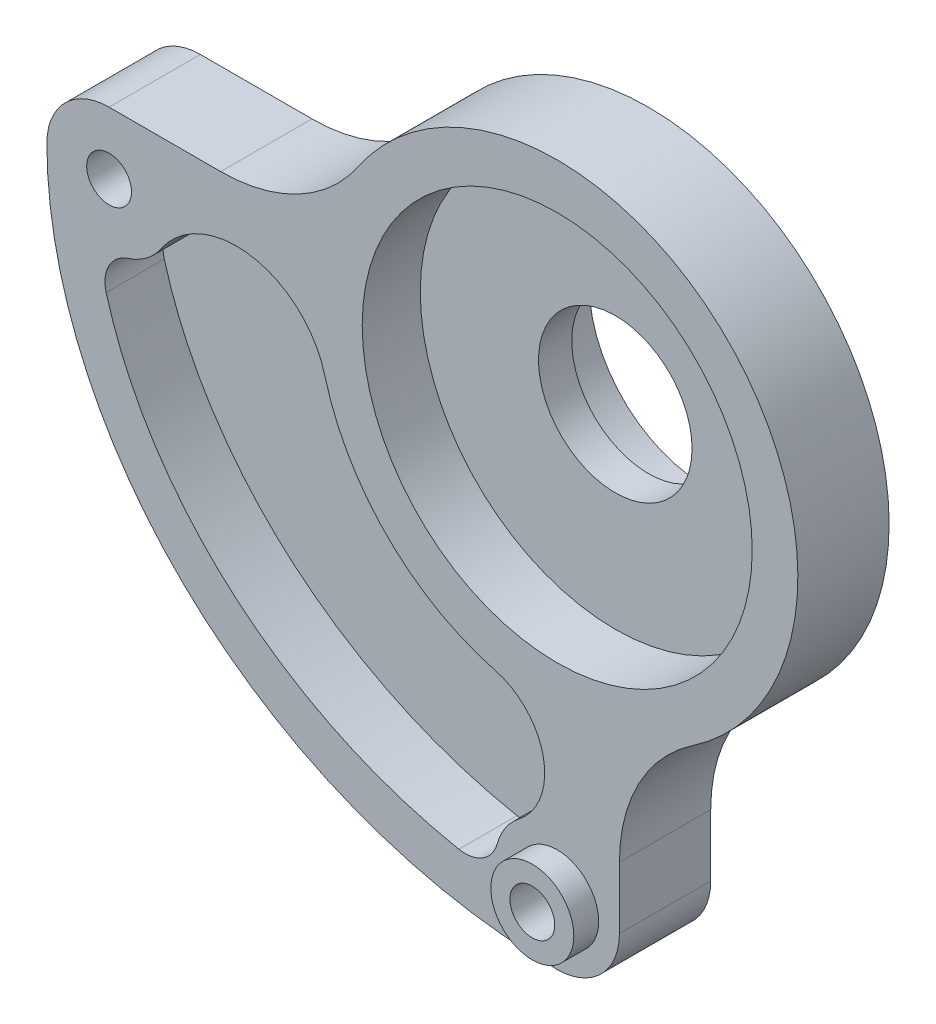
ISO-10303-21;
HEADER;
FILE_DESCRIPTION(('STEP AP214'),'2;1');
FILE_NAME('part.step','',(''),(''),'','','');
FILE_SCHEMA(('AUTOMOTIVE_DESIGN { 1 0 10303 214 1 1 1 1 }'));
ENDSEC;
DATA;
#1=APPLICATION_CONTEXT('core data for automotive mechanical design processes');
#2=APPLICATION_PROTOCOL_DEFINITION('international standard','automotive_design',2000,#1);
#3=PRODUCT_CONTEXT('',#1,'mechanical');
#4=PRODUCT('Part','Part','',(#3));
#5=PRODUCT_RELATED_PRODUCT_CATEGORY('part','',(#4));
#6=PRODUCT_DEFINITION_FORMATION('','',#4);
#7=PRODUCT_DEFINITION_CONTEXT('part definition',#1,'design');
#8=PRODUCT_DEFINITION('design','',#6,#7);
#9=PRODUCT_DEFINITION_SHAPE('','',#8);
#10=(LENGTH_UNIT() NAMED_UNIT(*) SI_UNIT(.MILLI.,.METRE.));
#11=(NAMED_UNIT(*) PLANE_ANGLE_UNIT() SI_UNIT($,.RADIAN.));
#12=(NAMED_UNIT(*) SI_UNIT($,.STERADIAN.) SOLID_ANGLE_UNIT());
#13=UNCERTAINTY_MEASURE_WITH_UNIT(LENGTH_MEASURE(1.E-05),#10,'distance_accuracy_value','');
#14=(GEOMETRIC_REPRESENTATION_CONTEXT(3) GLOBAL_UNCERTAINTY_ASSIGNED_CONTEXT((#13)) GLOBAL_UNIT_ASSIGNED_CONTEXT((#10,
#11,#12)) REPRESENTATION_CONTEXT('',''));
#15=CARTESIAN_POINT('',(0.,0.,0.));
#16=DIRECTION('',(0.,0.,1.));
#17=DIRECTION('',(1.,0.,0.));
#18=AXIS2_PLACEMENT_3D('',#15,#16,#17);
#19=CARTESIAN_POINT('',(0.,0.,8.93));
#20=DIRECTION('',(0.,0.,1.));
#21=DIRECTION('',(1.,0.,0.));
#22=AXIS2_PLACEMENT_3D('',#19,#20,#21);
#23=PLANE('',#22);
#24=CARTESIAN_POINT('',(-28.0011801821374,-8.45388369909683E-05,8.93));
#25=CARTESIAN_POINT('',(-28.0011232421343,-3.23355608710236,8.93));
#26=CARTESIAN_POINT('',(-26.5801767404547,-9.70171557995317,8.93));
#27=CARTESIAN_POINT('',(-20.4333715128919,-18.0293929282947,8.93));
#28=CARTESIAN_POINT('',(-12.653019421962,-22.727558911828,8.93));
#29=CARTESIAN_POINT('',(-5.55262158830502,-24.6710685207622,8.93));
#30=CARTESIAN_POINT('',(-1.84494688072152,-25.0003433157603,8.93));
#31=CARTESIAN_POINT('',(6.57625961889916E-05,-25.0003108259041,8.93));
#32=B_SPLINE_CURVE_WITH_KNOTS('',3,(#24,#25,#26,#27,#28,#29,#30,#31),.UNSPECIFIED.,.F.,.F.,(4,1,
1,1,1,4),(0.,0.392699081698724,0.785398163397448,1.17809724509617,1.37444678594553,
1.5707963267949),.UNSPECIFIED.);
#33=CARTESIAN_POINT('',(-27.1773193384946,-6.01212685681124,8.93));
#34=VERTEX_POINT('',#33);
#35=CARTESIAN_POINT('',(-5.92226507473119,-24.4342817661505,8.93));
#36=VERTEX_POINT('',#35);
#37=EDGE_CURVE('E165',#34,#36,#32,.T.);
#38=ORIENTED_EDGE('',*,*,#37,.F.);
#39=CARTESIAN_POINT('',(-25.2501618620842,-5.47727728813279,8.93));
#40=DIRECTION('',(0.,0.,1.));
#41=DIRECTION('',(1.,0.,0.));
#42=AXIS2_PLACEMENT_3D('',#39,#40,#41);
#43=CIRCLE('',#42,2.);
#44=CARTESIAN_POINT('',(-25.8588012144027,-3.57213736182573,8.93));
#45=VERTEX_POINT('',#44);
#46=EDGE_CURVE('E11',#34,#45,#43,.F.);
#47=ORIENTED_EDGE('',*,*,#46,.T.);
#48=CARTESIAN_POINT('',(-27.,0.,8.93));
#49=DIRECTION('',(0.,0.,1.));
#50=DIRECTION('',(1.,0.,0.));
#51=AXIS2_PLACEMENT_3D('',#48,#49,#50);
#52=CIRCLE('',#51,3.75);
#53=CARTESIAN_POINT('',(-23.8876689189189,-2.09186405909578,8.93));
#54=VERTEX_POINT('',#53);
#55=EDGE_CURVE('E384',#45,#54,#52,.T.);
#56=ORIENTED_EDGE('',*,*,#55,.T.);
#57=CARTESIAN_POINT('',(-19.3229166666667,-5.15993134576959,8.93));
#58=DIRECTION('',(0.,0.,1.));
#59=DIRECTION('',(1.,0.,0.));
#60=AXIS2_PLACEMENT_3D('',#57,#58,#59);
#61=CIRCLE('',#60,5.5);
#62=CARTESIAN_POINT('',(-14.0091145833333,-3.74095022568295,8.93));
#63=VERTEX_POINT('',#62);
#64=EDGE_CURVE('E157',#63,#54,#61,.T.);
#65=ORIENTED_EDGE('',*,*,#64,.F.);
#66=CARTESIAN_POINT('',(0.,0.,8.93));
#67=DIRECTION('',(0.,0.,1.));
#68=DIRECTION('',(1.,0.,0.));
#69=AXIS2_PLACEMENT_3D('',#66,#67,#68);
#70=CIRCLE('',#69,14.5);
#71=CARTESIAN_POINT('',(-3.72562957224472,-14.0131967905405,8.93));
#72=VERTEX_POINT('',#71);
#73=EDGE_CURVE('E170',#63,#72,#70,.T.);
#74=ORIENTED_EDGE('',*,*,#73,.T.);
#75=CARTESIAN_POINT('',(-4.75338945424325,-17.87890625,8.93));
#76=DIRECTION('',(0.,0.,1.));
#77=DIRECTION('',(1.,0.,0.));
#78=AXIS2_PLACEMENT_3D('',#75,#76,#77);
#79=CIRCLE('',#78,4.);
#80=CARTESIAN_POINT('',(-2.30002715527899,-21.0381804435484,8.93));
#81=VERTEX_POINT('',#80);
#82=EDGE_CURVE('E150',#81,#72,#79,.T.);
#83=ORIENTED_EDGE('',*,*,#82,.F.);
#84=CARTESIAN_POINT('',(0.,-24.,8.93));
#85=DIRECTION('',(0.,0.,1.));
#86=DIRECTION('',(1.,0.,0.));
#87=AXIS2_PLACEMENT_3D('',#84,#85,#86);
#88=CIRCLE('',#87,3.75);
#89=CARTESIAN_POINT('',(-3.61491619177204,-23.002562820793,8.93));
#90=VERTEX_POINT('',#89);
#91=EDGE_CURVE('E161',#81,#90,#88,.T.);
#92=ORIENTED_EDGE('',*,*,#91,.T.);
#93=CARTESIAN_POINT('',(-5.54287149405046,-22.470596325216,8.93));
#94=DIRECTION('',(0.,0.,1.));
#95=DIRECTION('',(1.,0.,0.));
#96=AXIS2_PLACEMENT_3D('',#93,#94,#95);
#97=CIRCLE('',#96,2.);
#98=EDGE_CURVE('E41',#90,#36,#97,.F.);
#99=ORIENTED_EDGE('',*,*,#98,.T.);
#100=EDGE_LOOP('',(#38,#47,#56,#65,#74,#83,#92,#99));
#101=FACE_BOUND('',#100,.T.);
#102=CARTESIAN_POINT('',(-27.,0.,8.93));
#103=DIRECTION('',(0.,0.,1.));
#104=DIRECTION('',(1.,0.,0.));
#105=AXIS2_PLACEMENT_3D('',#102,#103,#104);
#106=CIRCLE('',#105,1.35000000000001);
#107=CARTESIAN_POINT('',(-25.65,0.,8.93));
#108=VERTEX_POINT('',#107);
#109=EDGE_CURVE('E218',#108,#108,#106,.T.);
#110=ORIENTED_EDGE('',*,*,#109,.F.);
#111=EDGE_LOOP('',(#110));
#112=FACE_BOUND('',#111,.T.);
#113=CARTESIAN_POINT('',(0.,0.,8.93));
#114=DIRECTION('',(0.,0.,1.));
#115=DIRECTION('',(1.,0.,0.));
#116=AXIS2_PLACEMENT_3D('',#113,#114,#115);
#117=CIRCLE('',#116,11.75);
#118=CARTESIAN_POINT('',(11.75,0.,8.93));
#119=VERTEX_POINT('',#118);
#120=EDGE_CURVE('E224',#119,#119,#117,.T.);
#121=ORIENTED_EDGE('',*,*,#120,.F.);
#122=EDGE_LOOP('',(#121));
#123=FACE_BOUND('',#122,.T.);
#124=CARTESIAN_POINT('',(-20.2777587518937,13.75,8.93));
#125=DIRECTION('',(0.,0.,-1.));
#126=DIRECTION('',(1.,0.,0.));
#127=AXIS2_PLACEMENT_3D('',#124,#125,#126);
#128=CIRCLE('',#127,10.);
#129=CARTESIAN_POINT('',(-12.0011225266309,8.13775510204081,8.93));
#130=VERTEX_POINT('',#129);
#131=CARTESIAN_POINT('',(-20.2777587518937,3.75,8.93));
#132=VERTEX_POINT('',#131);
#133=EDGE_CURVE('E227',#130,#132,#128,.T.);
#134=ORIENTED_EDGE('',*,*,#133,.T.);
#135=DIRECTION('',(-1.,0.,0.));
#136=VECTOR('',#135,1.);
#137=CARTESIAN_POINT('',(-27.,3.75,8.93));
#138=LINE('',#137,#136);
#139=CARTESIAN_POINT('',(-27.,3.75,8.93));
#140=VERTEX_POINT('',#139);
#141=EDGE_CURVE('E232',#132,#140,#138,.T.);
#142=ORIENTED_EDGE('',*,*,#141,.T.);
#143=CARTESIAN_POINT('',(-27.,0.,8.93));
#144=DIRECTION('',(0.,0.,1.));
#145=DIRECTION('',(1.,0.,0.));
#146=AXIS2_PLACEMENT_3D('',#143,#144,#145);
#147=CIRCLE('',#146,3.75);
#148=CARTESIAN_POINT('',(-30.75,0.,8.93));
#149=VERTEX_POINT('',#148);
#150=EDGE_CURVE('E234',#140,#149,#147,.T.);
#151=ORIENTED_EDGE('',*,*,#150,.T.);
#152=CARTESIAN_POINT('',(0.,0.,8.93));
#153=DIRECTION('',(0.,0.,1.));
#154=DIRECTION('',(-1.,0.,0.));
#155=AXIS2_PLACEMENT_3D('',#152,#153,#154);
#156=ELLIPSE('',#155,30.75,27.75);
#157=CARTESIAN_POINT('',(0.,-27.75,8.93));
#158=VERTEX_POINT('',#157);
#159=EDGE_CURVE('E236',#149,#158,#156,.T.);
#160=ORIENTED_EDGE('',*,*,#159,.T.);
#161=CARTESIAN_POINT('',(0.,-24.,8.93));
#162=DIRECTION('',(0.,0.,1.));
#163=DIRECTION('',(1.,0.,0.));
#164=AXIS2_PLACEMENT_3D('',#161,#162,#163);
#165=CIRCLE('',#164,3.75);
#166=CARTESIAN_POINT('',(3.75,-24.,8.93));
#167=VERTEX_POINT('',#166);
#168=EDGE_CURVE('E239',#158,#167,#165,.T.);
#169=ORIENTED_EDGE('',*,*,#168,.T.);
#170=DIRECTION('',(0.,1.,0.));
#171=VECTOR('',#170,1.);
#172=CARTESIAN_POINT('',(3.75,-24.,8.93));
#173=LINE('',#172,#171);
#174=CARTESIAN_POINT('',(3.75,-20.2777587518937,8.93));
#175=VERTEX_POINT('',#174);
#176=EDGE_CURVE('E326',#167,#175,#173,.T.);
#177=ORIENTED_EDGE('',*,*,#176,.T.);
#178=CARTESIAN_POINT('',(13.75,-20.2777587518937,8.93));
#179=DIRECTION('',(0.,0.,-1.));
#180=DIRECTION('',(-1.,0.,0.));
#181=AXIS2_PLACEMENT_3D('',#178,#179,#180);
#182=CIRCLE('',#181,10.);
#183=CARTESIAN_POINT('',(8.13775510204082,-12.0011225266309,8.93));
#184=VERTEX_POINT('',#183);
#185=EDGE_CURVE('E694',#175,#184,#182,.T.);
#186=ORIENTED_EDGE('',*,*,#185,.T.);
#187=CARTESIAN_POINT('',(0.,0.,8.93));
#188=DIRECTION('',(0.,0.,1.));
#189=DIRECTION('',(1.,0.,0.));
#190=AXIS2_PLACEMENT_3D('',#187,#188,#189);
#191=CIRCLE('',#190,14.5);
#192=EDGE_CURVE('E687',#184,#130,#191,.T.);
#193=ORIENTED_EDGE('',*,*,#192,.T.);
#194=EDGE_LOOP('',(#134,#142,#151,#160,#169,#177,#186,#193));
#195=FACE_BOUND('',#194,.T.);
#196=CARTESIAN_POINT('',(0.,-24.,8.93));
#197=DIRECTION('',(0.,0.,1.));
#198=DIRECTION('',(1.,0.,0.));
#199=AXIS2_PLACEMENT_3D('',#196,#197,#198);
#200=CIRCLE('',#199,2.5);
#201=CARTESIAN_POINT('',(2.5,-24.,8.93));
#202=VERTEX_POINT('',#201);
#203=EDGE_CURVE('E389',#202,#202,#200,.T.);
#204=ORIENTED_EDGE('',*,*,#203,.F.);
#205=EDGE_LOOP('',(#204));
#206=FACE_BOUND('',#205,.T.);
#207=ADVANCED_FACE('F33',(#101,#112,#123,#195,#206),#23,.T.);
#208=CARTESIAN_POINT('',(0.,0.,5.43));
#209=DIRECTION('',(0.,0.,-1.));
#210=DIRECTION('',(-1.,0.,0.));
#211=AXIS2_PLACEMENT_3D('',#208,#209,#210);
#212=CYLINDRICAL_SURFACE('',#211,14.5);
#213=DIRECTION('',(0.,0.,-1.));
#214=VECTOR('',#213,1.);
#215=CARTESIAN_POINT('',(8.13775510204082,-12.0011225266309,8.93));
#216=LINE('',#215,#214);
#217=CARTESIAN_POINT('',(8.13775510204082,-12.0011225266309,3.43));
#218=VERTEX_POINT('',#217);
#219=EDGE_CURVE('E700',#184,#218,#216,.T.);
#220=ORIENTED_EDGE('',*,*,#219,.T.);
#221=CARTESIAN_POINT('',(0.,0.,3.43));
#222=DIRECTION('',(0.,0.,1.));
#223=DIRECTION('',(1.,0.,0.));
#224=AXIS2_PLACEMENT_3D('',#221,#222,#223);
#225=CIRCLE('',#224,14.5);
#226=CARTESIAN_POINT('',(-12.0011225266309,8.13775510204081,3.42999999999999));
#227=VERTEX_POINT('',#226);
#228=EDGE_CURVE('E352',#218,#227,#225,.T.);
#229=ORIENTED_EDGE('',*,*,#228,.T.);
#230=DIRECTION('',(0.,0.,-1.));
#231=VECTOR('',#230,1.);
#232=CARTESIAN_POINT('',(-12.0011225266309,8.13775510204081,8.93));
#233=LINE('',#232,#231);
#234=EDGE_CURVE('E698',#130,#227,#233,.T.);
#235=ORIENTED_EDGE('',*,*,#234,.F.);
#236=ORIENTED_EDGE('',*,*,#192,.F.);
#237=EDGE_LOOP('',(#220,#229,#235,#236));
#238=FACE_BOUND('',#237,.T.);
#239=ADVANCED_FACE('F270',(#238),#212,.T.);
#240=CARTESIAN_POINT('',(0.,0.,5.43));
#241=DIRECTION('',(0.,0.,1.));
#242=DIRECTION('',(1.,0.,0.));
#243=AXIS2_PLACEMENT_3D('',#240,#241,#242);
#244=PLANE('',#243);
#245=CARTESIAN_POINT('',(0.,0.,5.43));
#246=DIRECTION('',(0.,0.,1.));
#247=DIRECTION('',(1.,0.,0.));
#248=AXIS2_PLACEMENT_3D('',#245,#246,#247);
#249=CIRCLE('',#248,4.625);
#250=CARTESIAN_POINT('',(4.625,0.,5.43));
#251=VERTEX_POINT('',#250);
#252=EDGE_CURVE('E349',#251,#251,#249,.T.);
#253=ORIENTED_EDGE('',*,*,#252,.F.);
#254=EDGE_LOOP('',(#253));
#255=FACE_BOUND('',#254,.T.);
#256=CARTESIAN_POINT('',(0.,0.,5.43));
#257=DIRECTION('',(0.,0.,1.));
#258=DIRECTION('',(1.,0.,0.));
#259=AXIS2_PLACEMENT_3D('',#256,#257,#258);
#260=CIRCLE('',#259,11.75);
#261=CARTESIAN_POINT('',(11.75,0.,5.43));
#262=VERTEX_POINT('',#261);
#263=EDGE_CURVE('E223',#262,#262,#260,.T.);
#264=ORIENTED_EDGE('',*,*,#263,.T.);
#265=EDGE_LOOP('',(#264));
#266=FACE_BOUND('',#265,.T.);
#267=ADVANCED_FACE('F266',(#255,#266),#244,.T.);
#268=CARTESIAN_POINT('',(0.,0.,0.));
#269=DIRECTION('',(0.,0.,1.));
#270=DIRECTION('',(1.,0.,0.));
#271=AXIS2_PLACEMENT_3D('',#268,#269,#270);
#272=PLANE('',#271);
#273=CARTESIAN_POINT('',(0.,0.,0.));
#274=DIRECTION('',(0.,0.,1.));
#275=DIRECTION('',(1.,0.,0.));
#276=AXIS2_PLACEMENT_3D('',#273,#274,#275);
#277=CIRCLE('',#276,8.);
#278=CARTESIAN_POINT('',(-8.,0.,0.));
#279=VERTEX_POINT('',#278);
#280=EDGE_CURVE('E363',#279,#279,#277,.T.);
#281=ORIENTED_EDGE('',*,*,#280,.F.);
#282=EDGE_LOOP('',(#281));
#283=FACE_BOUND('',#282,.T.);
#284=CARTESIAN_POINT('',(0.,0.,0.));
#285=DIRECTION('',(0.,0.,1.));
#286=DIRECTION('',(1.,0.,0.));
#287=AXIS2_PLACEMENT_3D('',#284,#285,#286);
#288=CIRCLE('',#287,7.);
#289=CARTESIAN_POINT('',(-7.,0.,0.));
#290=VERTEX_POINT('',#289);
#291=EDGE_CURVE('E360',#290,#290,#288,.T.);
#292=ORIENTED_EDGE('',*,*,#291,.T.);
#293=EDGE_LOOP('',(#292));
#294=FACE_BOUND('',#293,.T.);
#295=ADVANCED_FACE('F269',(#283,#294),#272,.F.);
#296=CARTESIAN_POINT('',(0.,0.,3.43));
#297=DIRECTION('',(0.,0.,-1.));
#298=DIRECTION('',(-1.,0.,0.));
#299=AXIS2_PLACEMENT_3D('',#296,#297,#298);
#300=CYLINDRICAL_SURFACE('',#299,8.);
#301=CARTESIAN_POINT('',(0.,0.,3.43));
#302=DIRECTION('',(0.,0.,1.));
#303=DIRECTION('',(1.,0.,0.));
#304=AXIS2_PLACEMENT_3D('',#301,#302,#303);
#305=CIRCLE('',#304,8.);
#306=CARTESIAN_POINT('',(-8.,0.,3.43));
#307=VERTEX_POINT('',#306);
#308=EDGE_CURVE('E364',#307,#307,#305,.T.);
#309=CARTESIAN_POINT('',(-8.,0.,3.43));
#310=CARTESIAN_POINT('',(-8.,0.,3.39427083333333));
#311=CARTESIAN_POINT('',(-8.,0.,3.35854166666667));
#312=CARTESIAN_POINT('',(-8.,0.,3.28708333333333));
#313=CARTESIAN_POINT('',(-8.,0.,3.25135416666667));
#314=CARTESIAN_POINT('',(-8.,0.,3.17989583333333));
#315=CARTESIAN_POINT('',(-8.,0.,3.14416666666667));
#316=CARTESIAN_POINT('',(-8.,0.,3.07270833333333));
#317=CARTESIAN_POINT('',(-8.,0.,3.03697916666667));
#318=CARTESIAN_POINT('',(-8.,0.,2.96552083333333));
#319=CARTESIAN_POINT('',(-8.,0.,2.92979166666667));
#320=CARTESIAN_POINT('',(-8.,0.,2.85833333333333));
#321=CARTESIAN_POINT('',(-8.,0.,2.82260416666667));
#322=CARTESIAN_POINT('',(-8.,0.,2.75114583333333));
#323=CARTESIAN_POINT('',(-8.,0.,2.71541666666667));
#324=CARTESIAN_POINT('',(-8.,0.,2.64395833333333));
#325=CARTESIAN_POINT('',(-8.,0.,2.60822916666667));
#326=CARTESIAN_POINT('',(-8.,0.,2.53677083333333));
#327=CARTESIAN_POINT('',(-8.,0.,2.50104166666667));
#328=CARTESIAN_POINT('',(-8.,0.,2.42958333333333));
#329=CARTESIAN_POINT('',(-8.,0.,2.39385416666667));
#330=CARTESIAN_POINT('',(-8.,0.,2.32239583333333));
#331=CARTESIAN_POINT('',(-8.,0.,2.28666666666667));
#332=CARTESIAN_POINT('',(-8.,0.,2.21520833333333));
#333=CARTESIAN_POINT('',(-8.,0.,2.17947916666667));
#334=CARTESIAN_POINT('',(-8.,0.,2.10802083333333));
#335=CARTESIAN_POINT('',(-8.,0.,2.07229166666667));
#336=CARTESIAN_POINT('',(-8.,0.,2.00083333333333));
#337=CARTESIAN_POINT('',(-8.,0.,1.96510416666667));
#338=CARTESIAN_POINT('',(-8.,0.,1.89364583333333));
#339=CARTESIAN_POINT('',(-8.,0.,1.85791666666667));
#340=CARTESIAN_POINT('',(-8.,0.,1.78645833333333));
#341=CARTESIAN_POINT('',(-8.,0.,1.75072916666667));
#342=CARTESIAN_POINT('',(-8.,0.,1.67927083333333));
#343=CARTESIAN_POINT('',(-8.,0.,1.64354166666667));
#344=CARTESIAN_POINT('',(-8.,0.,1.57208333333333));
#345=CARTESIAN_POINT('',(-8.,0.,1.53635416666667));
#346=CARTESIAN_POINT('',(-8.,0.,1.46489583333333));
#347=CARTESIAN_POINT('',(-8.,0.,1.42916666666667));
#348=CARTESIAN_POINT('',(-8.,0.,1.35770833333333));
#349=CARTESIAN_POINT('',(-8.,0.,1.32197916666667));
#350=CARTESIAN_POINT('',(-8.,0.,1.25052083333333));
#351=CARTESIAN_POINT('',(-8.,0.,1.21479166666667));
#352=CARTESIAN_POINT('',(-8.,0.,1.14333333333333));
#353=CARTESIAN_POINT('',(-8.,0.,1.10760416666667));
#354=CARTESIAN_POINT('',(-8.,0.,1.03614583333333));
#355=CARTESIAN_POINT('',(-8.,0.,1.00041666666667));
#356=CARTESIAN_POINT('',(-8.,0.,0.928958333333334));
#357=CARTESIAN_POINT('',(-8.,0.,0.893229166666667));
#358=CARTESIAN_POINT('',(-8.,0.,0.821770833333334));
#359=CARTESIAN_POINT('',(-8.,0.,0.786041666666667));
#360=CARTESIAN_POINT('',(-8.,0.,0.714583333333333));
#361=CARTESIAN_POINT('',(-8.,0.,0.678854166666667));
#362=CARTESIAN_POINT('',(-8.,0.,0.607395833333333));
#363=CARTESIAN_POINT('',(-8.,0.,0.571666666666667));
#364=CARTESIAN_POINT('',(-8.,0.,0.500208333333333));
#365=CARTESIAN_POINT('',(-8.,0.,0.464479166666667));
#366=CARTESIAN_POINT('',(-8.,0.,0.393020833333333));
#367=CARTESIAN_POINT('',(-8.,0.,0.357291666666667));
#368=CARTESIAN_POINT('',(-8.,0.,0.285833333333334));
#369=CARTESIAN_POINT('',(-8.,0.,0.250104166666667));
#370=CARTESIAN_POINT('',(-8.,0.,0.178645833333333));
#371=CARTESIAN_POINT('',(-8.,0.,0.142916666666667));
#372=CARTESIAN_POINT('',(-8.,0.,0.0714583333333334));
#373=CARTESIAN_POINT('',(-8.,0.,0.0357291666666667));
#374=CARTESIAN_POINT('',(-8.,0.,0.));
#375=B_SPLINE_CURVE_WITH_KNOTS('',3,(#309,#310,#311,#312,#313,#314,#315,#316,#317,#318,#319,
#320,#321,#322,#323,#324,#325,#326,#327,#328,#329,#330,#331,#332,#333,#334,#335,#336,#337,#338,
#339,#340,#341,#342,#343,#344,#345,#346,#347,#348,#349,#350,#351,#352,#353,#354,#355,#356,#357,
#358,#359,#360,#361,#362,#363,#364,#365,#366,#367,#368,#369,#370,#371,#372,#373,#374),
.UNSPECIFIED.,.F.,.F.,(4,2,2,2,2,2,2,2,2,2,2,2,2,2,2,2,2,2,2,2,2,2,2,2,2,2,2,2,2,2,2,2,4),(0.,
0.1071875,0.214375,0.3215625,0.42875,0.5359375,0.643125,0.7503125,0.8575,0.9646875,1.071875,
1.1790625,1.28625,1.3934375,1.500625,1.6078125,1.715,1.8221875,1.929375,2.0365625,2.14375,
2.2509375,2.358125,2.4653125,2.5725,2.6796875,2.786875,2.8940625,3.00125,3.1084375,3.215625,
3.3228125,3.43),.UNSPECIFIED.);
#376=EDGE_CURVE('BSEAM282',#307,#279,#375,.T.);
#377=ORIENTED_EDGE('',*,*,#308,.F.);
#378=ORIENTED_EDGE('',*,*,#280,.T.);
#379=ORIENTED_EDGE('',*,*,#376,.T.);
#380=ORIENTED_EDGE('',*,*,#376,.F.);
#381=EDGE_LOOP('',(#377,#379,#378,#380));
#382=FACE_BOUND('',#381,.T.);
#383=ADVANCED_FACE('F282',(#382),#300,.T.);
#384=CARTESIAN_POINT('',(0.,0.,3.43));
#385=DIRECTION('',(0.,0.,-1.));
#386=DIRECTION('',(-1.,0.,0.));
#387=AXIS2_PLACEMENT_3D('',#384,#385,#386);
#388=CYLINDRICAL_SURFACE('',#387,7.);
#389=CARTESIAN_POINT('',(0.,0.,3.43));
#390=DIRECTION('',(0.,0.,1.));
#391=DIRECTION('',(1.,0.,0.));
#392=AXIS2_PLACEMENT_3D('',#389,#390,#391);
#393=CIRCLE('',#392,7.);
#394=CARTESIAN_POINT('',(-7.,0.,3.43));
#395=VERTEX_POINT('',#394);
#396=EDGE_CURVE('E357',#395,#395,#393,.T.);
#397=CARTESIAN_POINT('',(-7.,0.,3.43));
#398=CARTESIAN_POINT('',(-7.,0.,3.39427083333333));
#399=CARTESIAN_POINT('',(-7.,0.,3.35854166666667));
#400=CARTESIAN_POINT('',(-7.,0.,3.28708333333333));
#401=CARTESIAN_POINT('',(-7.,0.,3.25135416666667));
#402=CARTESIAN_POINT('',(-7.,0.,3.17989583333333));
#403=CARTESIAN_POINT('',(-7.,0.,3.14416666666667));
#404=CARTESIAN_POINT('',(-7.,0.,3.07270833333333));
#405=CARTESIAN_POINT('',(-7.,0.,3.03697916666667));
#406=CARTESIAN_POINT('',(-7.,0.,2.96552083333333));
#407=CARTESIAN_POINT('',(-7.,0.,2.92979166666667));
#408=CARTESIAN_POINT('',(-7.,0.,2.85833333333333));
#409=CARTESIAN_POINT('',(-7.,0.,2.82260416666667));
#410=CARTESIAN_POINT('',(-7.,0.,2.75114583333333));
#411=CARTESIAN_POINT('',(-7.,0.,2.71541666666667));
#412=CARTESIAN_POINT('',(-7.,0.,2.64395833333333));
#413=CARTESIAN_POINT('',(-7.,0.,2.60822916666667));
#414=CARTESIAN_POINT('',(-7.,0.,2.53677083333333));
#415=CARTESIAN_POINT('',(-7.,0.,2.50104166666667));
#416=CARTESIAN_POINT('',(-7.,0.,2.42958333333333));
#417=CARTESIAN_POINT('',(-7.,0.,2.39385416666667));
#418=CARTESIAN_POINT('',(-7.,0.,2.32239583333333));
#419=CARTESIAN_POINT('',(-7.,0.,2.28666666666667));
#420=CARTESIAN_POINT('',(-7.,0.,2.21520833333333));
#421=CARTESIAN_POINT('',(-7.,0.,2.17947916666667));
#422=CARTESIAN_POINT('',(-7.,0.,2.10802083333333));
#423=CARTESIAN_POINT('',(-7.,0.,2.07229166666667));
#424=CARTESIAN_POINT('',(-7.,0.,2.00083333333333));
#425=CARTESIAN_POINT('',(-7.,0.,1.96510416666667));
#426=CARTESIAN_POINT('',(-7.,0.,1.89364583333333));
#427=CARTESIAN_POINT('',(-7.,0.,1.85791666666667));
#428=CARTESIAN_POINT('',(-7.,0.,1.78645833333333));
#429=CARTESIAN_POINT('',(-7.,0.,1.75072916666667));
#430=CARTESIAN_POINT('',(-7.,0.,1.67927083333333));
#431=CARTESIAN_POINT('',(-7.,0.,1.64354166666667));
#432=CARTESIAN_POINT('',(-7.,0.,1.57208333333333));
#433=CARTESIAN_POINT('',(-7.,0.,1.53635416666667));
#434=CARTESIAN_POINT('',(-7.,0.,1.46489583333333));
#435=CARTESIAN_POINT('',(-7.,0.,1.42916666666667));
#436=CARTESIAN_POINT('',(-7.,0.,1.35770833333333));
#437=CARTESIAN_POINT('',(-7.,0.,1.32197916666667));
#438=CARTESIAN_POINT('',(-7.,0.,1.25052083333333));
#439=CARTESIAN_POINT('',(-7.,0.,1.21479166666667));
#440=CARTESIAN_POINT('',(-7.,0.,1.14333333333333));
#441=CARTESIAN_POINT('',(-7.,0.,1.10760416666667));
#442=CARTESIAN_POINT('',(-7.,0.,1.03614583333333));
#443=CARTESIAN_POINT('',(-7.,0.,1.00041666666667));
#444=CARTESIAN_POINT('',(-7.,0.,0.928958333333334));
#445=CARTESIAN_POINT('',(-7.,0.,0.893229166666667));
#446=CARTESIAN_POINT('',(-7.,0.,0.821770833333334));
#447=CARTESIAN_POINT('',(-7.,0.,0.786041666666667));
#448=CARTESIAN_POINT('',(-7.,0.,0.714583333333333));
#449=CARTESIAN_POINT('',(-7.,0.,0.678854166666667));
#450=CARTESIAN_POINT('',(-7.,0.,0.607395833333333));
#451=CARTESIAN_POINT('',(-7.,0.,0.571666666666667));
#452=CARTESIAN_POINT('',(-7.,0.,0.500208333333333));
#453=CARTESIAN_POINT('',(-7.,0.,0.464479166666667));
#454=CARTESIAN_POINT('',(-7.,0.,0.393020833333334));
#455=CARTESIAN_POINT('',(-7.,0.,0.357291666666667));
#456=CARTESIAN_POINT('',(-7.,0.,0.285833333333334));
#457=CARTESIAN_POINT('',(-7.,0.,0.250104166666667));
#458=CARTESIAN_POINT('',(-7.,0.,0.178645833333333));
#459=CARTESIAN_POINT('',(-7.,0.,0.142916666666667));
#460=CARTESIAN_POINT('',(-7.,0.,0.0714583333333334));
#461=CARTESIAN_POINT('',(-7.,0.,0.0357291666666667));
#462=CARTESIAN_POINT('',(-7.,0.,0.));
#463=B_SPLINE_CURVE_WITH_KNOTS('',3,(#397,#398,#399,#400,#401,#402,#403,#404,#405,#406,#407,
#408,#409,#410,#411,#412,#413,#414,#415,#416,#417,#418,#419,#420,#421,#422,#423,#424,#425,#426,
#427,#428,#429,#430,#431,#432,#433,#434,#435,#436,#437,#438,#439,#440,#441,#442,#443,#444,#445,
#446,#447,#448,#449,#450,#451,#452,#453,#454,#455,#456,#457,#458,#459,#460,#461,#462),
.UNSPECIFIED.,.F.,.F.,(4,2,2,2,2,2,2,2,2,2,2,2,2,2,2,2,2,2,2,2,2,2,2,2,2,2,2,2,2,2,2,2,4),(0.,
0.1071875,0.214375,0.3215625,0.42875,0.5359375,0.643125,0.7503125,0.8575,0.9646875,1.071875,
1.1790625,1.28625,1.3934375,1.500625,1.6078125,1.715,1.8221875,1.929375,2.0365625,2.14375,
2.2509375,2.358125,2.4653125,2.5725,2.6796875,2.786875,2.8940625,3.00125,3.1084375,3.215625,
3.3228125,3.43),.UNSPECIFIED.);
#464=EDGE_CURVE('BSEAM279',#395,#290,#463,.T.);
#465=ORIENTED_EDGE('',*,*,#396,.T.);
#466=ORIENTED_EDGE('',*,*,#291,.F.);
#467=ORIENTED_EDGE('',*,*,#464,.T.);
#468=ORIENTED_EDGE('',*,*,#464,.F.);
#469=EDGE_LOOP('',(#465,#467,#466,#468));
#470=FACE_BOUND('',#469,.T.);
#471=ADVANCED_FACE('F279',(#470),#388,.F.);
#472=CARTESIAN_POINT('',(0.,0.,3.43));
#473=DIRECTION('',(0.,0.,1.));
#474=DIRECTION('',(1.,0.,0.));
#475=AXIS2_PLACEMENT_3D('',#472,#473,#474);
#476=PLANE('',#475);
#477=CARTESIAN_POINT('',(0.,0.,3.43));
#478=DIRECTION('',(0.,0.,1.));
#479=DIRECTION('',(1.,0.,0.));
#480=AXIS2_PLACEMENT_3D('',#477,#478,#479);
#481=CIRCLE('',#480,4.625);
#482=CARTESIAN_POINT('',(4.625,0.,3.43));
#483=VERTEX_POINT('',#482);
#484=EDGE_CURVE('E348',#483,#483,#481,.T.);
#485=ORIENTED_EDGE('',*,*,#484,.T.);
#486=EDGE_LOOP('',(#485));
#487=FACE_BOUND('',#486,.T.);
#488=ORIENTED_EDGE('',*,*,#396,.F.);
#489=EDGE_LOOP('',(#488));
#490=FACE_BOUND('',#489,.T.);
#491=ADVANCED_FACE('F274',(#487,#490),#476,.F.);
#492=ORIENTED_EDGE('',*,*,#308,.T.);
#493=EDGE_LOOP('',(#492));
#494=FACE_BOUND('',#493,.T.);
#495=ORIENTED_EDGE('',*,*,#228,.F.);
#496=CARTESIAN_POINT('',(13.75,-20.2777587518937,3.43));
#497=DIRECTION('',(0.,0.,1.));
#498=DIRECTION('',(1.,0.,0.));
#499=AXIS2_PLACEMENT_3D('',#496,#497,#498);
#500=CIRCLE('',#499,10.);
#501=CARTESIAN_POINT('',(3.75,-20.2777587518937,3.43));
#502=VERTEX_POINT('',#501);
#503=EDGE_CURVE('E189',#502,#218,#500,.F.);
#504=ORIENTED_EDGE('',*,*,#503,.F.);
#505=DIRECTION('',(0.,1.,0.));
#506=VECTOR('',#505,1.);
#507=CARTESIAN_POINT('',(3.75,-20.2777587518937,3.43));
#508=LINE('',#507,#506);
#509=CARTESIAN_POINT('',(3.75,-24.,3.43));
#510=VERTEX_POINT('',#509);
#511=EDGE_CURVE('E196',#510,#502,#508,.T.);
#512=ORIENTED_EDGE('',*,*,#511,.F.);
#513=CARTESIAN_POINT('',(0.,-24.,3.43));
#514=DIRECTION('',(0.,0.,1.));
#515=DIRECTION('',(1.,0.,0.));
#516=AXIS2_PLACEMENT_3D('',#513,#514,#515);
#517=CIRCLE('',#516,3.75);
#518=CARTESIAN_POINT('',(0.,-27.75,3.42999999999999));
#519=VERTEX_POINT('',#518);
#520=EDGE_CURVE('E199',#519,#510,#517,.T.);
#521=ORIENTED_EDGE('',*,*,#520,.F.);
#522=CARTESIAN_POINT('',(0.,0.,3.42999999999999));
#523=DIRECTION('',(0.,0.,-1.));
#524=DIRECTION('',(-1.,0.,0.));
#525=AXIS2_PLACEMENT_3D('',#522,#523,#524);
#526=ELLIPSE('',#525,30.75,27.75);
#527=CARTESIAN_POINT('',(-30.75,0.,3.43));
#528=VERTEX_POINT('',#527);
#529=EDGE_CURVE('E202',#528,#519,#526,.F.);
#530=ORIENTED_EDGE('',*,*,#529,.F.);
#531=CARTESIAN_POINT('',(-27.,0.,3.43));
#532=DIRECTION('',(0.,0.,1.));
#533=DIRECTION('',(1.,0.,0.));
#534=AXIS2_PLACEMENT_3D('',#531,#532,#533);
#535=CIRCLE('',#534,3.75);
#536=CARTESIAN_POINT('',(-27.,3.75,3.43));
#537=VERTEX_POINT('',#536);
#538=EDGE_CURVE('E205',#537,#528,#535,.T.);
#539=ORIENTED_EDGE('',*,*,#538,.F.);
#540=DIRECTION('',(-1.,0.,0.));
#541=VECTOR('',#540,1.);
#542=CARTESIAN_POINT('',(-27.,3.75,3.43));
#543=LINE('',#542,#541);
#544=CARTESIAN_POINT('',(-20.2777587518937,3.75,3.43));
#545=VERTEX_POINT('',#544);
#546=EDGE_CURVE('E208',#545,#537,#543,.T.);
#547=ORIENTED_EDGE('',*,*,#546,.F.);
#548=CARTESIAN_POINT('',(-20.2777587518937,13.75,3.43));
#549=DIRECTION('',(0.,0.,1.));
#550=DIRECTION('',(1.,0.,0.));
#551=AXIS2_PLACEMENT_3D('',#548,#549,#550);
#552=CIRCLE('',#551,10.);
#553=EDGE_CURVE('E211',#227,#545,#552,.F.);
#554=ORIENTED_EDGE('',*,*,#553,.F.);
#555=EDGE_LOOP('',(#495,#504,#512,#521,#530,#539,#547,#554));
#556=FACE_BOUND('',#555,.T.);
#557=CARTESIAN_POINT('',(0.,-24.,3.43));
#558=DIRECTION('',(0.,0.,1.));
#559=DIRECTION('',(1.,0.,0.));
#560=AXIS2_PLACEMENT_3D('',#557,#558,#559);
#561=CIRCLE('',#560,1.35);
#562=CARTESIAN_POINT('',(1.35,-24.,3.43));
#563=VERTEX_POINT('',#562);
#564=EDGE_CURVE('E214',#563,#563,#561,.T.);
#565=ORIENTED_EDGE('',*,*,#564,.T.);
#566=EDGE_LOOP('',(#565));
#567=FACE_BOUND('',#566,.T.);
#568=CARTESIAN_POINT('',(-27.,0.,3.43));
#569=DIRECTION('',(0.,0.,1.));
#570=DIRECTION('',(1.,0.,0.));
#571=AXIS2_PLACEMENT_3D('',#568,#569,#570);
#572=CIRCLE('',#571,1.35);
#573=CARTESIAN_POINT('',(-25.65,0.,3.43));
#574=VERTEX_POINT('',#573);
#575=EDGE_CURVE('E215',#574,#574,#572,.T.);
#576=ORIENTED_EDGE('',*,*,#575,.T.);
#577=EDGE_LOOP('',(#576));
#578=FACE_BOUND('',#577,.T.);
#579=ADVANCED_FACE('F264',(#494,#556,#567,#578),#476,.F.);
#580=CARTESIAN_POINT('',(0.,0.,5.43));
#581=DIRECTION('',(0.,0.,-1.));
#582=DIRECTION('',(-1.,0.,0.));
#583=AXIS2_PLACEMENT_3D('',#580,#581,#582);
#584=CYLINDRICAL_SURFACE('',#583,4.625);
#585=ORIENTED_EDGE('',*,*,#252,.T.);
#586=EDGE_LOOP('',(#585));
#587=FACE_BOUND('',#586,.T.);
#588=ORIENTED_EDGE('',*,*,#484,.F.);
#589=EDGE_LOOP('',(#588));
#590=FACE_BOUND('',#589,.T.);
#591=ADVANCED_FACE('F260',(#587,#590),#584,.F.);
#592=CARTESIAN_POINT('',(-20.2777587518937,13.75,8.93));
#593=DIRECTION('',(0.,0.,-1.));
#594=DIRECTION('',(-1.,0.,0.));
#595=AXIS2_PLACEMENT_3D('',#592,#593,#594);
#596=CYLINDRICAL_SURFACE('',#595,10.);
#597=ORIENTED_EDGE('',*,*,#234,.T.);
#598=ORIENTED_EDGE('',*,*,#553,.T.);
#599=DIRECTION('',(0.,0.,-1.));
#600=VECTOR('',#599,1.);
#601=CARTESIAN_POINT('',(-20.2777587518937,3.75,8.93));
#602=LINE('',#601,#600);
#603=EDGE_CURVE('E346',#132,#545,#602,.T.);
#604=ORIENTED_EDGE('',*,*,#603,.F.);
#605=ORIENTED_EDGE('',*,*,#133,.F.);
#606=EDGE_LOOP('',(#597,#598,#604,#605));
#607=FACE_BOUND('',#606,.T.);
#608=ADVANCED_FACE('F256',(#607),#596,.F.);
#609=CARTESIAN_POINT('',(-27.,3.75,8.93));
#610=DIRECTION('',(0.,-1.,0.));
#611=DIRECTION('',(0.,0.,-1.));
#612=AXIS2_PLACEMENT_3D('',#609,#610,#611);
#613=PLANE('',#612);
#614=ORIENTED_EDGE('',*,*,#603,.T.);
#615=ORIENTED_EDGE('',*,*,#546,.T.);
#616=DIRECTION('',(0.,0.,-1.));
#617=VECTOR('',#616,1.);
#618=CARTESIAN_POINT('',(-27.,3.75,8.93));
#619=LINE('',#618,#617);
#620=EDGE_CURVE('E341',#140,#537,#619,.T.);
#621=ORIENTED_EDGE('',*,*,#620,.F.);
#622=ORIENTED_EDGE('',*,*,#141,.F.);
#623=EDGE_LOOP('',(#614,#615,#621,#622));
#624=FACE_BOUND('',#623,.T.);
#625=ADVANCED_FACE('F252',(#624),#613,.F.);
#626=CARTESIAN_POINT('',(-27.,0.,8.93));
#627=DIRECTION('',(0.,0.,-1.));
#628=DIRECTION('',(-1.,0.,0.));
#629=AXIS2_PLACEMENT_3D('',#626,#627,#628);
#630=CYLINDRICAL_SURFACE('',#629,3.75);
#631=ORIENTED_EDGE('',*,*,#620,.T.);
#632=ORIENTED_EDGE('',*,*,#538,.T.);
#633=DIRECTION('',(0.,0.,-1.));
#634=VECTOR('',#633,1.);
#635=CARTESIAN_POINT('',(-30.75,0.,8.93));
#636=LINE('',#635,#634);
#637=EDGE_CURVE('E339',#149,#528,#636,.T.);
#638=ORIENTED_EDGE('',*,*,#637,.F.);
#639=ORIENTED_EDGE('',*,*,#150,.F.);
#640=EDGE_LOOP('',(#631,#632,#638,#639));
#641=FACE_BOUND('',#640,.T.);
#642=ADVANCED_FACE('F247',(#641),#630,.T.);
#643=DIRECTION('',(0.,0.,-1.));
#644=VECTOR('',#643,1.);
#645=SURFACE_OF_LINEAR_EXTRUSION('',#156,#644);
#646=ORIENTED_EDGE('',*,*,#637,.T.);
#647=ORIENTED_EDGE('',*,*,#529,.T.);
#648=DIRECTION('',(0.,0.,-1.));
#649=VECTOR('',#648,1.);
#650=CARTESIAN_POINT('',(0.,-27.75,8.93));
#651=LINE('',#650,#649);
#652=EDGE_CURVE('E328',#158,#519,#651,.T.);
#653=ORIENTED_EDGE('',*,*,#652,.F.);
#654=ORIENTED_EDGE('',*,*,#159,.F.);
#655=EDGE_LOOP('',(#646,#647,#653,#654));
#656=FACE_BOUND('',#655,.T.);
#657=ADVANCED_FACE('F242',(#656),#645,.F.);
#658=CARTESIAN_POINT('',(0.,-24.,8.93));
#659=DIRECTION('',(0.,0.,-1.));
#660=DIRECTION('',(-1.,0.,0.));
#661=AXIS2_PLACEMENT_3D('',#658,#659,#660);
#662=CYLINDRICAL_SURFACE('',#661,3.75);
#663=ORIENTED_EDGE('',*,*,#652,.T.);
#664=ORIENTED_EDGE('',*,*,#520,.T.);
#665=DIRECTION('',(0.,0.,-1.));
#666=VECTOR('',#665,1.);
#667=CARTESIAN_POINT('',(3.75,-24.,8.93));
#668=LINE('',#667,#666);
#669=EDGE_CURVE('E323',#167,#510,#668,.T.);
#670=ORIENTED_EDGE('',*,*,#669,.F.);
#671=ORIENTED_EDGE('',*,*,#168,.F.);
#672=EDGE_LOOP('',(#663,#664,#670,#671));
#673=FACE_BOUND('',#672,.T.);
#674=ADVANCED_FACE('F246',(#673),#662,.T.);
#675=CARTESIAN_POINT('',(3.75,-24.,8.93));
#676=DIRECTION('',(-1.,0.,0.));
#677=DIRECTION('',(0.,-1.,0.));
#678=AXIS2_PLACEMENT_3D('',#675,#676,#677);
#679=PLANE('',#678);
#680=ORIENTED_EDGE('',*,*,#669,.T.);
#681=ORIENTED_EDGE('',*,*,#511,.T.);
#682=DIRECTION('',(0.,0.,-1.));
#683=VECTOR('',#682,1.);
#684=CARTESIAN_POINT('',(3.75,-20.2777587518937,8.93));
#685=LINE('',#684,#683);
#686=EDGE_CURVE('E329',#175,#502,#685,.T.);
#687=ORIENTED_EDGE('',*,*,#686,.F.);
#688=ORIENTED_EDGE('',*,*,#176,.F.);
#689=EDGE_LOOP('',(#680,#681,#687,#688));
#690=FACE_BOUND('',#689,.T.);
#691=ADVANCED_FACE('F313',(#690),#679,.F.);
#692=CARTESIAN_POINT('',(13.75,-20.2777587518937,8.93));
#693=DIRECTION('',(0.,0.,-1.));
#694=DIRECTION('',(-1.,0.,0.));
#695=AXIS2_PLACEMENT_3D('',#692,#693,#694);
#696=CYLINDRICAL_SURFACE('',#695,10.);
#697=ORIENTED_EDGE('',*,*,#686,.T.);
#698=ORIENTED_EDGE('',*,*,#503,.T.);
#699=ORIENTED_EDGE('',*,*,#219,.F.);
#700=ORIENTED_EDGE('',*,*,#185,.F.);
#701=EDGE_LOOP('',(#697,#698,#699,#700));
#702=FACE_BOUND('',#701,.T.);
#703=ADVANCED_FACE('F311',(#702),#696,.F.);
#704=CARTESIAN_POINT('',(0.,0.,8.93));
#705=DIRECTION('',(0.,0.,-1.));
#706=DIRECTION('',(-1.,0.,0.));
#707=AXIS2_PLACEMENT_3D('',#704,#705,#706);
#708=CYLINDRICAL_SURFACE('',#707,11.75);
#709=ORIENTED_EDGE('',*,*,#120,.T.);
#710=EDGE_LOOP('',(#709));
#711=FACE_BOUND('',#710,.T.);
#712=ORIENTED_EDGE('',*,*,#263,.F.);
#713=EDGE_LOOP('',(#712));
#714=FACE_BOUND('',#713,.T.);
#715=ADVANCED_FACE('F309',(#711,#714),#708,.F.);
#716=CARTESIAN_POINT('',(0.,-24.,8.93));
#717=DIRECTION('',(0.,0.,-1.));
#718=DIRECTION('',(-1.,0.,0.));
#719=AXIS2_PLACEMENT_3D('',#716,#717,#718);
#720=CYLINDRICAL_SURFACE('',#719,1.34999999999995);
#721=ORIENTED_EDGE('',*,*,#564,.F.);
#722=EDGE_LOOP('',(#721));
#723=FACE_BOUND('',#722,.T.);
#724=CARTESIAN_POINT('',(0.,-24.,10.43));
#725=DIRECTION('',(0.,0.,1.));
#726=DIRECTION('',(1.,0.,0.));
#727=AXIS2_PLACEMENT_3D('',#724,#725,#726);
#728=CIRCLE('',#727,1.34999999999995);
#729=CARTESIAN_POINT('',(1.34999999999995,-24.,10.43));
#730=VERTEX_POINT('',#729);
#731=EDGE_CURVE('E427',#730,#730,#728,.T.);
#732=ORIENTED_EDGE('',*,*,#731,.T.);
#733=EDGE_LOOP('',(#732));
#734=FACE_BOUND('',#733,.T.);
#735=ADVANCED_FACE('F415',(#723,#734),#720,.F.);
#736=CARTESIAN_POINT('',(-27.,0.,8.93));
#737=DIRECTION('',(0.,0.,-1.));
#738=DIRECTION('',(-1.,0.,0.));
#739=AXIS2_PLACEMENT_3D('',#736,#737,#738);
#740=CYLINDRICAL_SURFACE('',#739,1.35000000000001);
#741=ORIENTED_EDGE('',*,*,#109,.T.);
#742=EDGE_LOOP('',(#741));
#743=FACE_BOUND('',#742,.T.);
#744=ORIENTED_EDGE('',*,*,#575,.F.);
#745=EDGE_LOOP('',(#744));
#746=FACE_BOUND('',#745,.T.);
#747=ADVANCED_FACE('F413',(#743,#746),#740,.F.);
#748=CARTESIAN_POINT('',(-27.,0.,-31.4077791502855));
#749=DIRECTION('',(0.,0.,1.));
#750=DIRECTION('',(1.,0.,0.));
#751=AXIS2_PLACEMENT_3D('',#748,#749,#750);
#752=CYLINDRICAL_SURFACE('',#751,3.75);
#753=ORIENTED_EDGE('',*,*,#55,.F.);
#754=DIRECTION('',(0.,0.,1.));
#755=VECTOR('',#754,1.);
#756=CARTESIAN_POINT('',(-25.8588012144027,-3.57213736182573,-31.4077791502855));
#757=LINE('',#756,#755);
#758=CARTESIAN_POINT('',(-25.8588012144027,-3.57213736182573,5.43));
#759=VERTEX_POINT('',#758);
#760=EDGE_CURVE('E53',#45,#759,#757,.F.);
#761=ORIENTED_EDGE('',*,*,#760,.T.);
#762=CARTESIAN_POINT('',(-27.,0.,5.43));
#763=DIRECTION('',(0.,0.,1.));
#764=DIRECTION('',(1.,0.,0.));
#765=AXIS2_PLACEMENT_3D('',#762,#763,#764);
#766=CIRCLE('',#765,3.75);
#767=CARTESIAN_POINT('',(-23.8876689189189,-2.09186405909578,5.43));
#768=VERTEX_POINT('',#767);
#769=EDGE_CURVE('E190',#768,#759,#766,.F.);
#770=ORIENTED_EDGE('',*,*,#769,.F.);
#771=DIRECTION('',(0.,0.,1.));
#772=VECTOR('',#771,1.);
#773=CARTESIAN_POINT('',(-23.8876689189189,-2.09186405909578,-31.4077791502855));
#774=LINE('',#773,#772);
#775=EDGE_CURVE('E177',#768,#54,#774,.T.);
#776=ORIENTED_EDGE('',*,*,#775,.T.);
#777=EDGE_LOOP('',(#753,#761,#770,#776));
#778=FACE_BOUND('',#777,.T.);
#779=ADVANCED_FACE('F409',(#778),#752,.T.);
#780=CARTESIAN_POINT('',(-19.3229166666667,-5.15993134576959,-31.4077791502855));
#781=DIRECTION('',(0.,0.,1.));
#782=DIRECTION('',(1.,0.,0.));
#783=AXIS2_PLACEMENT_3D('',#780,#781,#782);
#784=CYLINDRICAL_SURFACE('',#783,5.5);
#785=CARTESIAN_POINT('',(-19.3229166666667,-5.15993134576959,5.43));
#786=DIRECTION('',(0.,0.,1.));
#787=DIRECTION('',(1.,0.,0.));
#788=AXIS2_PLACEMENT_3D('',#785,#786,#787);
#789=CIRCLE('',#788,5.5);
#790=CARTESIAN_POINT('',(-14.0091145833333,-3.74095022568295,5.43));
#791=VERTEX_POINT('',#790);
#792=EDGE_CURVE('E394',#768,#791,#789,.F.);
#793=ORIENTED_EDGE('',*,*,#792,.T.);
#794=DIRECTION('',(0.,0.,1.));
#795=VECTOR('',#794,1.);
#796=CARTESIAN_POINT('',(-14.0091145833333,-3.74095022568295,-31.4077791502855));
#797=LINE('',#796,#795);
#798=EDGE_CURVE('E181',#791,#63,#797,.T.);
#799=ORIENTED_EDGE('',*,*,#798,.T.);
#800=ORIENTED_EDGE('',*,*,#64,.T.);
#801=ORIENTED_EDGE('',*,*,#775,.F.);
#802=EDGE_LOOP('',(#793,#799,#800,#801));
#803=FACE_BOUND('',#802,.T.);
#804=ADVANCED_FACE('F412',(#803),#784,.F.);
#805=CARTESIAN_POINT('',(0.,0.,-31.4077791502855));
#806=DIRECTION('',(0.,0.,1.));
#807=DIRECTION('',(1.,0.,0.));
#808=AXIS2_PLACEMENT_3D('',#805,#806,#807);
#809=CYLINDRICAL_SURFACE('',#808,14.5);
#810=DIRECTION('',(0.,0.,1.));
#811=VECTOR('',#810,1.);
#812=CARTESIAN_POINT('',(-3.72562957224472,-14.0131967905405,-31.4077791502855));
#813=LINE('',#812,#811);
#814=CARTESIAN_POINT('',(-3.72562957224472,-14.0131967905405,5.43));
#815=VERTEX_POINT('',#814);
#816=EDGE_CURVE('E156',#815,#72,#813,.T.);
#817=ORIENTED_EDGE('',*,*,#816,.T.);
#818=ORIENTED_EDGE('',*,*,#73,.F.);
#819=ORIENTED_EDGE('',*,*,#798,.F.);
#820=CARTESIAN_POINT('',(0.,0.,5.43));
#821=DIRECTION('',(0.,0.,1.));
#822=DIRECTION('',(1.,0.,0.));
#823=AXIS2_PLACEMENT_3D('',#820,#821,#822);
#824=CIRCLE('',#823,14.5);
#825=EDGE_CURVE('E386',#815,#791,#824,.F.);
#826=ORIENTED_EDGE('',*,*,#825,.F.);
#827=EDGE_LOOP('',(#817,#818,#819,#826));
#828=FACE_BOUND('',#827,.T.);
#829=ADVANCED_FACE('F440',(#828),#809,.T.);
#830=CARTESIAN_POINT('',(-4.75338945424325,-17.87890625,-31.4077791502855));
#831=DIRECTION('',(0.,0.,1.));
#832=DIRECTION('',(1.,0.,0.));
#833=AXIS2_PLACEMENT_3D('',#830,#831,#832);
#834=CYLINDRICAL_SURFACE('',#833,4.);
#835=CARTESIAN_POINT('',(-4.75338945424325,-17.87890625,5.43));
#836=DIRECTION('',(0.,0.,1.));
#837=DIRECTION('',(1.,0.,0.));
#838=AXIS2_PLACEMENT_3D('',#835,#836,#837);
#839=CIRCLE('',#838,4.);
#840=CARTESIAN_POINT('',(-2.30002715527899,-21.0381804435484,5.43));
#841=VERTEX_POINT('',#840);
#842=EDGE_CURVE('E153',#815,#841,#839,.F.);
#843=ORIENTED_EDGE('',*,*,#842,.T.);
#844=DIRECTION('',(0.,0.,1.));
#845=VECTOR('',#844,1.);
#846=CARTESIAN_POINT('',(-2.30002715527899,-21.0381804435484,-31.4077791502855));
#847=LINE('',#846,#845);
#848=EDGE_CURVE('E145',#841,#81,#847,.T.);
#849=ORIENTED_EDGE('',*,*,#848,.T.);
#850=ORIENTED_EDGE('',*,*,#82,.T.);
#851=ORIENTED_EDGE('',*,*,#816,.F.);
#852=EDGE_LOOP('',(#843,#849,#850,#851));
#853=FACE_BOUND('',#852,.T.);
#854=ADVANCED_FACE('F147',(#853),#834,.F.);
#855=CARTESIAN_POINT('',(0.,-24.,-31.4077791502855));
#856=DIRECTION('',(0.,0.,1.));
#857=DIRECTION('',(1.,0.,0.));
#858=AXIS2_PLACEMENT_3D('',#855,#856,#857);
#859=CYLINDRICAL_SURFACE('',#858,3.75);
#860=CARTESIAN_POINT('',(0.,-24.,5.43));
#861=DIRECTION('',(0.,0.,1.));
#862=DIRECTION('',(1.,0.,0.));
#863=AXIS2_PLACEMENT_3D('',#860,#861,#862);
#864=CIRCLE('',#863,3.75);
#865=CARTESIAN_POINT('',(-3.61491619177204,-23.002562820793,5.43));
#866=VERTEX_POINT('',#865);
#867=EDGE_CURVE('E180',#866,#841,#864,.F.);
#868=ORIENTED_EDGE('',*,*,#867,.F.);
#869=DIRECTION('',(0.,0.,1.));
#870=VECTOR('',#869,1.);
#871=CARTESIAN_POINT('',(-3.61491619177204,-23.002562820793,-31.4077791502855));
#872=LINE('',#871,#870);
#873=EDGE_CURVE('E164',#866,#90,#872,.T.);
#874=ORIENTED_EDGE('',*,*,#873,.T.);
#875=ORIENTED_EDGE('',*,*,#91,.F.);
#876=ORIENTED_EDGE('',*,*,#848,.F.);
#877=EDGE_LOOP('',(#868,#874,#875,#876));
#878=FACE_BOUND('',#877,.T.);
#879=ADVANCED_FACE('F162',(#878),#859,.T.);
#880=CARTESIAN_POINT('',(-28.0011801821374,-8.45388369909683E-05,-31.4077791502855));
#881=CARTESIAN_POINT('',(-28.0011232421343,-3.23355608710236,-31.4077791502855));
#882=CARTESIAN_POINT('',(-26.5801767404547,-9.70171557995317,-31.4077791502855));
#883=CARTESIAN_POINT('',(-20.4333715128919,-18.0293929282947,-31.4077791502855));
#884=CARTESIAN_POINT('',(-12.653019421962,-22.727558911828,-31.4077791502855));
#885=CARTESIAN_POINT('',(-5.55262158830502,-24.6710685207622,-31.4077791502855));
#886=CARTESIAN_POINT('',(-1.84494688072152,-25.0003433157603,-31.4077791502855));
#887=CARTESIAN_POINT('',(6.57625961889916E-05,-25.0003108259041,-31.4077791502855));
#888=B_SPLINE_CURVE_WITH_KNOTS('',3,(#880,#881,#882,#883,#884,#885,#886,#887),.UNSPECIFIED.,.F.,
.F.,(4,1,1,1,1,4),(0.,0.392699081698724,0.785398163397448,1.17809724509617,1.37444678594553,
1.5707963267949),.UNSPECIFIED.);
#889=DIRECTION('',(0.,0.,1.));
#890=VECTOR('',#889,1.);
#891=SURFACE_OF_LINEAR_EXTRUSION('',#888,#890);
#892=ORIENTED_EDGE('',*,*,#37,.T.);
#893=DIRECTION('',(0.,0.,1.));
#894=VECTOR('',#893,1.);
#895=CARTESIAN_POINT('',(-5.92226507473119,-24.4342817661505,8.93));
#896=LINE('',#895,#894);
#897=CARTESIAN_POINT('',(-5.92226507473119,-24.4342817661505,5.43));
#898=VERTEX_POINT('',#897);
#899=EDGE_CURVE('E373',#36,#898,#896,.F.);
#900=ORIENTED_EDGE('',*,*,#899,.T.);
#901=CARTESIAN_POINT('',(-28.0011801821374,-8.45388369909683E-05,5.43));
#902=CARTESIAN_POINT('',(-28.0011232421343,-3.23355608710236,5.43));
#903=CARTESIAN_POINT('',(-26.5801767404547,-9.70171557995317,5.43));
#904=CARTESIAN_POINT('',(-20.4333715128919,-18.0293929282947,5.43));
#905=CARTESIAN_POINT('',(-12.653019421962,-22.727558911828,5.43));
#906=CARTESIAN_POINT('',(-5.55262158830502,-24.6710685207622,5.43));
#907=CARTESIAN_POINT('',(-1.84494688072152,-25.0003433157603,5.43));
#908=CARTESIAN_POINT('',(6.57625961889916E-05,-25.0003108259041,5.43));
#909=B_SPLINE_CURVE_WITH_KNOTS('',3,(#901,#902,#903,#904,#905,#906,#907,#908),.UNSPECIFIED.,.F.,
.F.,(4,1,1,1,1,4),(0.,0.392699081698724,0.785398163397448,1.17809724509617,1.37444678594553,
1.5707963267949),.UNSPECIFIED.);
#910=CARTESIAN_POINT('',(-27.1773193384947,-6.01212685681066,5.43));
#911=VERTEX_POINT('',#910);
#912=EDGE_CURVE('E184',#898,#911,#909,.F.);
#913=ORIENTED_EDGE('',*,*,#912,.T.);
#914=DIRECTION('',(0.,0.,1.));
#915=VECTOR('',#914,1.);
#916=CARTESIAN_POINT('',(-27.1773193384947,-6.01212685681064,5.42999999999999));
#917=LINE('',#916,#915);
#918=EDGE_CURVE('E370',#911,#34,#917,.T.);
#919=ORIENTED_EDGE('',*,*,#918,.T.);
#920=EDGE_LOOP('',(#892,#900,#913,#919));
#921=FACE_BOUND('',#920,.T.);
#922=ADVANCED_FACE('F299',(#921),#891,.F.);
#923=CARTESIAN_POINT('',(0.,0.,5.43));
#924=DIRECTION('',(0.,0.,1.));
#925=DIRECTION('',(1.,0.,0.));
#926=AXIS2_PLACEMENT_3D('',#923,#924,#925);
#927=PLANE('',#926);
#928=ORIENTED_EDGE('',*,*,#912,.F.);
#929=CARTESIAN_POINT('',(-5.54287149405046,-22.470596325216,5.43));
#930=DIRECTION('',(0.,0.,1.));
#931=DIRECTION('',(1.,0.,0.));
#932=AXIS2_PLACEMENT_3D('',#929,#930,#931);
#933=CIRCLE('',#932,2.);
#934=EDGE_CURVE('E377',#898,#866,#933,.T.);
#935=ORIENTED_EDGE('',*,*,#934,.T.);
#936=ORIENTED_EDGE('',*,*,#867,.T.);
#937=ORIENTED_EDGE('',*,*,#842,.F.);
#938=ORIENTED_EDGE('',*,*,#825,.T.);
#939=ORIENTED_EDGE('',*,*,#792,.F.);
#940=ORIENTED_EDGE('',*,*,#769,.T.);
#941=CARTESIAN_POINT('',(-25.2501618620842,-5.47727728813279,5.43));
#942=DIRECTION('',(0.,0.,1.));
#943=DIRECTION('',(1.,0.,0.));
#944=AXIS2_PLACEMENT_3D('',#941,#942,#943);
#945=CIRCLE('',#944,2.);
#946=EDGE_CURVE('E375',#759,#911,#945,.T.);
#947=ORIENTED_EDGE('',*,*,#946,.T.);
#948=EDGE_LOOP('',(#928,#935,#936,#937,#938,#939,#940,#947));
#949=FACE_BOUND('',#948,.T.);
#950=ADVANCED_FACE('F291',(#949),#927,.T.);
#951=CARTESIAN_POINT('',(-5.54287149405046,-22.470596325216,7.17999999999999));
#952=DIRECTION('',(0.,0.,1.));
#953=DIRECTION('',(1.,0.,0.));
#954=AXIS2_PLACEMENT_3D('',#951,#952,#953);
#955=CYLINDRICAL_SURFACE('',#954,2.);
#956=ORIENTED_EDGE('',*,*,#934,.F.);
#957=ORIENTED_EDGE('',*,*,#899,.F.);
#958=ORIENTED_EDGE('',*,*,#98,.F.);
#959=ORIENTED_EDGE('',*,*,#873,.F.);
#960=EDGE_LOOP('',(#956,#957,#958,#959));
#961=FACE_BOUND('',#960,.T.);
#962=ADVANCED_FACE('F289',(#961),#955,.F.);
#963=CARTESIAN_POINT('',(-25.2501618620842,-5.47727728813279,7.18));
#964=DIRECTION('',(0.,0.,1.));
#965=DIRECTION('',(1.,0.,0.));
#966=AXIS2_PLACEMENT_3D('',#963,#964,#965);
#967=CYLINDRICAL_SURFACE('',#966,2.);
#968=ORIENTED_EDGE('',*,*,#946,.F.);
#969=ORIENTED_EDGE('',*,*,#760,.F.);
#970=ORIENTED_EDGE('',*,*,#46,.F.);
#971=ORIENTED_EDGE('',*,*,#918,.F.);
#972=EDGE_LOOP('',(#968,#969,#970,#971));
#973=FACE_BOUND('',#972,.T.);
#974=ADVANCED_FACE('F35',(#973),#967,.F.);
#975=CARTESIAN_POINT('',(0.,-24.,10.43));
#976=DIRECTION('',(0.,0.,1.));
#977=DIRECTION('',(1.,0.,0.));
#978=AXIS2_PLACEMENT_3D('',#975,#976,#977);
#979=PLANE('',#978);
#980=CARTESIAN_POINT('',(0.,-24.,10.43));
#981=DIRECTION('',(0.,0.,1.));
#982=DIRECTION('',(1.,0.,0.));
#983=AXIS2_PLACEMENT_3D('',#980,#981,#982);
#984=CIRCLE('',#983,2.5);
#985=CARTESIAN_POINT('',(2.5,-24.,10.43));
#986=VERTEX_POINT('',#985);
#987=EDGE_CURVE('E431',#986,#986,#984,.T.);
#988=ORIENTED_EDGE('',*,*,#987,.T.);
#989=EDGE_LOOP('',(#988));
#990=FACE_BOUND('',#989,.T.);
#991=ORIENTED_EDGE('',*,*,#731,.F.);
#992=EDGE_LOOP('',(#991));
#993=FACE_BOUND('',#992,.T.);
#994=ADVANCED_FACE('F297',(#990,#993),#979,.T.);
#995=CARTESIAN_POINT('',(0.,-24.,10.43));
#996=DIRECTION('',(0.,0.,-1.));
#997=DIRECTION('',(-1.,0.,0.));
#998=AXIS2_PLACEMENT_3D('',#995,#996,#997);
#999=CYLINDRICAL_SURFACE('',#998,2.5);
#1000=ORIENTED_EDGE('',*,*,#987,.F.);
#1001=EDGE_LOOP('',(#1000));
#1002=FACE_BOUND('',#1001,.T.);
#1003=ORIENTED_EDGE('',*,*,#203,.T.);
#1004=EDGE_LOOP('',(#1003));
#1005=FACE_BOUND('',#1004,.T.);
#1006=ADVANCED_FACE('F450',(#1002,#1005),#999,.T.);
#1007=CLOSED_SHELL('',(#207,#239,#267,#295,#383,#471,#491,#579,#591,#608,#625,#642,#657,#674,
#691,#703,#715,#735,#747,#779,#804,#829,#854,#879,#922,#950,#962,#974,#994,#1006));
#1008=MANIFOLD_SOLID_BREP('B2',#1007);
#1009=ADVANCED_BREP_SHAPE_REPRESENTATION('',(#18,#1008),#14);
#1010=SHAPE_DEFINITION_REPRESENTATION(#9,#1009);
ENDSEC;
END-ISO-10303-21;
